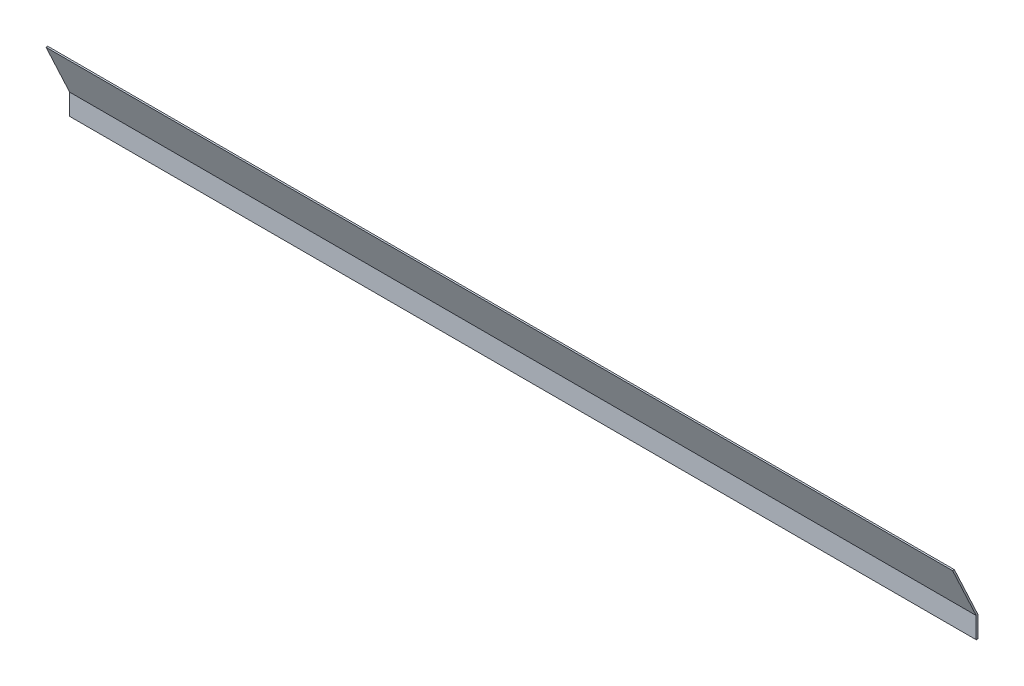
ISO-10303-21;
HEADER;
FILE_DESCRIPTION(('STEP AP214'),'2;1');
FILE_NAME('part.step','',(''),(''),'','','');
FILE_SCHEMA(('AUTOMOTIVE_DESIGN { 1 0 10303 214 1 1 1 1 }'));
ENDSEC;
DATA;
#1=APPLICATION_CONTEXT('core data for automotive mechanical design processes');
#2=APPLICATION_PROTOCOL_DEFINITION('international standard','automotive_design',2000,#1);
#3=PRODUCT_CONTEXT('',#1,'mechanical');
#4=PRODUCT('Part','Part','',(#3));
#5=PRODUCT_RELATED_PRODUCT_CATEGORY('part','',(#4));
#6=PRODUCT_DEFINITION_FORMATION('','',#4);
#7=PRODUCT_DEFINITION_CONTEXT('part definition',#1,'design');
#8=PRODUCT_DEFINITION('design','',#6,#7);
#9=PRODUCT_DEFINITION_SHAPE('','',#8);
#10=(LENGTH_UNIT() NAMED_UNIT(*) SI_UNIT(.MILLI.,.METRE.));
#11=(NAMED_UNIT(*) PLANE_ANGLE_UNIT() SI_UNIT($,.RADIAN.));
#12=(NAMED_UNIT(*) SI_UNIT($,.STERADIAN.) SOLID_ANGLE_UNIT());
#13=UNCERTAINTY_MEASURE_WITH_UNIT(LENGTH_MEASURE(1.E-05),#10,'distance_accuracy_value','');
#14=(GEOMETRIC_REPRESENTATION_CONTEXT(3) GLOBAL_UNCERTAINTY_ASSIGNED_CONTEXT((#13)) GLOBAL_UNIT_ASSIGNED_CONTEXT((#10,
#11,#12)) REPRESENTATION_CONTEXT('',''));
#15=CARTESIAN_POINT('',(0.,0.,0.));
#16=DIRECTION('',(0.,0.,1.));
#17=DIRECTION('',(1.,0.,0.));
#18=AXIS2_PLACEMENT_3D('',#15,#16,#17);
#19=CARTESIAN_POINT('',(0.,184.161742325847,92.2260307857102));
#20=DIRECTION('',(0.,-0.422618261740699,0.90630778703665));
#21=DIRECTION('',(0.,-0.90630778703665,-0.422618261740699));
#22=AXIS2_PLACEMENT_3D('',#19,#20,#21);
#23=PLANE('',#22);
#24=DIRECTION('',(0.,-0.90630778703665,-0.4226182617407));
#25=VECTOR('',#24,1.);
#26=CARTESIAN_POINT('',(3289.3,184.161742325847,92.2260307857102));
#27=LINE('',#26,#25);
#28=CARTESIAN_POINT('',(3289.3,184.161742325847,92.2260307857102));
#29=VERTEX_POINT('',#28);
#30=CARTESIAN_POINT('',(3289.3,0.,6.35000000000008));
#31=VERTEX_POINT('',#30);
#32=EDGE_CURVE('E103',#29,#31,#27,.T.);
#33=ORIENTED_EDGE('',*,*,#32,.F.);
#34=DIRECTION('',(1.,0.,0.));
#35=VECTOR('',#34,1.);
#36=CARTESIAN_POINT('',(0.,184.161742325847,92.2260307857102));
#37=LINE('',#36,#35);
#38=CARTESIAN_POINT('',(0.,184.161742325847,92.2260307857102));
#39=VERTEX_POINT('',#38);
#40=EDGE_CURVE('E75',#39,#29,#37,.T.);
#41=ORIENTED_EDGE('',*,*,#40,.F.);
#42=DIRECTION('',(0.,-0.90630778703665,-0.4226182617407));
#43=VECTOR('',#42,1.);
#44=CARTESIAN_POINT('',(0.,184.161742325847,92.2260307857102));
#45=LINE('',#44,#43);
#46=CARTESIAN_POINT('',(0.,0.,6.35000000000008));
#47=VERTEX_POINT('',#46);
#48=EDGE_CURVE('E72',#39,#47,#45,.T.);
#49=ORIENTED_EDGE('',*,*,#48,.T.);
#50=DIRECTION('',(1.,0.,0.));
#51=VECTOR('',#50,1.);
#52=CARTESIAN_POINT('',(0.,0.,6.35));
#53=LINE('',#52,#51);
#54=EDGE_CURVE('E20',#31,#47,#53,.F.);
#55=ORIENTED_EDGE('',*,*,#54,.F.);
#56=EDGE_LOOP('',(#33,#41,#49,#55));
#57=FACE_BOUND('',#56,.T.);
#58=ADVANCED_FACE('F17',(#57),#23,.T.);
#59=CARTESIAN_POINT('',(0.,0.,6.35));
#60=DIRECTION('',(0.,0.,1.));
#61=DIRECTION('',(1.,0.,0.));
#62=AXIS2_PLACEMENT_3D('',#59,#60,#61);
#63=PLANE('',#62);
#64=DIRECTION('',(0.,1.,0.));
#65=VECTOR('',#64,1.);
#66=CARTESIAN_POINT('',(3289.3,56.5193055194773,6.35));
#67=LINE('',#66,#65);
#68=CARTESIAN_POINT('',(3289.3,-76.2,6.35));
#69=VERTEX_POINT('',#68);
#70=EDGE_CURVE('E82',#31,#69,#67,.F.);
#71=ORIENTED_EDGE('',*,*,#70,.F.);
#72=ORIENTED_EDGE('',*,*,#54,.T.);
#73=DIRECTION('',(0.,1.,0.));
#74=VECTOR('',#73,1.);
#75=CARTESIAN_POINT('',(0.,56.5193055194773,6.35));
#76=LINE('',#75,#74);
#77=CARTESIAN_POINT('',(0.,-76.2,6.35));
#78=VERTEX_POINT('',#77);
#79=EDGE_CURVE('E67',#47,#78,#76,.F.);
#80=ORIENTED_EDGE('',*,*,#79,.T.);
#81=DIRECTION('',(1.,0.,0.));
#82=VECTOR('',#81,1.);
#83=CARTESIAN_POINT('',(0.,-76.2,6.35));
#84=LINE('',#83,#82);
#85=EDGE_CURVE('E78',#69,#78,#84,.F.);
#86=ORIENTED_EDGE('',*,*,#85,.F.);
#87=EDGE_LOOP('',(#71,#72,#80,#86));
#88=FACE_BOUND('',#87,.T.);
#89=ADVANCED_FACE('F80',(#88),#63,.T.);
#90=CARTESIAN_POINT('',(0.,-76.2,6.35));
#91=DIRECTION('',(0.,-1.,0.));
#92=DIRECTION('',(0.,0.,-1.));
#93=AXIS2_PLACEMENT_3D('',#90,#91,#92);
#94=PLANE('',#93);
#95=DIRECTION('',(0.,0.,-1.));
#96=VECTOR('',#95,1.);
#97=CARTESIAN_POINT('',(3289.3,-76.2,34.6628779547605));
#98=LINE('',#97,#96);
#99=CARTESIAN_POINT('',(3289.3,-76.2,0.));
#100=VERTEX_POINT('',#99);
#101=EDGE_CURVE('E96',#69,#100,#98,.T.);
#102=ORIENTED_EDGE('',*,*,#101,.F.);
#103=ORIENTED_EDGE('',*,*,#85,.T.);
#104=DIRECTION('',(0.,0.,-1.));
#105=VECTOR('',#104,1.);
#106=CARTESIAN_POINT('',(0.,-76.2,34.6628779547605));
#107=LINE('',#106,#105);
#108=CARTESIAN_POINT('',(0.,-76.2,0.));
#109=VERTEX_POINT('',#108);
#110=EDGE_CURVE('E87',#78,#109,#107,.T.);
#111=ORIENTED_EDGE('',*,*,#110,.T.);
#112=DIRECTION('',(-1.,0.,0.));
#113=VECTOR('',#112,1.);
#114=CARTESIAN_POINT('',(0.,-76.2,0.));
#115=LINE('',#114,#113);
#116=EDGE_CURVE('E98',#100,#109,#115,.T.);
#117=ORIENTED_EDGE('',*,*,#116,.F.);
#118=EDGE_LOOP('',(#102,#103,#111,#117));
#119=FACE_BOUND('',#118,.T.);
#120=ADVANCED_FACE('F94',(#119),#94,.T.);
#121=CARTESIAN_POINT('',(0.,56.5193055194773,34.6628779547605));
#122=DIRECTION('',(1.,0.,0.));
#123=DIRECTION('',(0.,0.,-1.));
#124=AXIS2_PLACEMENT_3D('',#121,#122,#123);
#125=PLANE('',#124);
#126=ORIENTED_EDGE('',*,*,#110,.F.);
#127=ORIENTED_EDGE('',*,*,#79,.F.);
#128=ORIENTED_EDGE('',*,*,#48,.F.);
#129=DIRECTION('',(0.,0.,1.));
#130=VECTOR('',#129,1.);
#131=CARTESIAN_POINT('',(0.,184.161742325847,85.8760307857102));
#132=LINE('',#131,#130);
#133=CARTESIAN_POINT('',(0.,184.161742325847,85.8760307857102));
#134=VERTEX_POINT('',#133);
#135=EDGE_CURVE('E89',#134,#39,#132,.T.);
#136=ORIENTED_EDGE('',*,*,#135,.F.);
#137=DIRECTION('',(0.,0.90630778703665,0.422618261740699));
#138=VECTOR('',#137,1.);
#139=CARTESIAN_POINT('',(0.,0.,0.));
#140=LINE('',#139,#138);
#141=CARTESIAN_POINT('',(0.,0.,0.));
#142=VERTEX_POINT('',#141);
#143=EDGE_CURVE('E116',#142,#134,#140,.T.);
#144=ORIENTED_EDGE('',*,*,#143,.F.);
#145=DIRECTION('',(0.,1.,0.));
#146=VECTOR('',#145,1.);
#147=CARTESIAN_POINT('',(0.,-76.2,0.));
#148=LINE('',#147,#146);
#149=EDGE_CURVE('E99',#109,#142,#148,.T.);
#150=ORIENTED_EDGE('',*,*,#149,.F.);
#151=EDGE_LOOP('',(#126,#127,#128,#136,#144,#150));
#152=FACE_BOUND('',#151,.T.);
#153=ADVANCED_FACE('F85',(#152),#125,.F.);
#154=CARTESIAN_POINT('',(0.,184.161742325847,85.8760307857102));
#155=DIRECTION('',(0.,1.,0.));
#156=DIRECTION('',(0.,0.,1.));
#157=AXIS2_PLACEMENT_3D('',#154,#155,#156);
#158=PLANE('',#157);
#159=DIRECTION('',(0.,0.,-1.));
#160=VECTOR('',#159,1.);
#161=CARTESIAN_POINT('',(3289.3,184.161742325847,34.6628779547605));
#162=LINE('',#161,#160);
#163=CARTESIAN_POINT('',(3289.3,184.161742325847,85.8760307857102));
#164=VERTEX_POINT('',#163);
#165=EDGE_CURVE('E105',#164,#29,#162,.F.);
#166=ORIENTED_EDGE('',*,*,#165,.F.);
#167=DIRECTION('',(1.,0.,0.));
#168=VECTOR('',#167,1.);
#169=CARTESIAN_POINT('',(0.,184.161742325847,85.8760307857101));
#170=LINE('',#169,#168);
#171=EDGE_CURVE('E114',#134,#164,#170,.T.);
#172=ORIENTED_EDGE('',*,*,#171,.F.);
#173=ORIENTED_EDGE('',*,*,#135,.T.);
#174=ORIENTED_EDGE('',*,*,#40,.T.);
#175=EDGE_LOOP('',(#166,#172,#173,#174));
#176=FACE_BOUND('',#175,.T.);
#177=ADVANCED_FACE('F112',(#176),#158,.T.);
#178=CARTESIAN_POINT('',(3289.3,56.5193055194773,34.6628779547605));
#179=DIRECTION('',(1.,0.,0.));
#180=DIRECTION('',(0.,0.,-1.));
#181=AXIS2_PLACEMENT_3D('',#178,#179,#180);
#182=PLANE('',#181);
#183=ORIENTED_EDGE('',*,*,#70,.T.);
#184=ORIENTED_EDGE('',*,*,#101,.T.);
#185=DIRECTION('',(0.,1.,0.));
#186=VECTOR('',#185,1.);
#187=CARTESIAN_POINT('',(3289.3,-76.2,0.));
#188=LINE('',#187,#186);
#189=CARTESIAN_POINT('',(3289.3,0.,0.));
#190=VERTEX_POINT('',#189);
#191=EDGE_CURVE('E35',#190,#100,#188,.F.);
#192=ORIENTED_EDGE('',*,*,#191,.F.);
#193=DIRECTION('',(0.,0.90630778703665,0.422618261740699));
#194=VECTOR('',#193,1.);
#195=CARTESIAN_POINT('',(3289.3,0.,0.));
#196=LINE('',#195,#194);
#197=EDGE_CURVE('E26',#164,#190,#196,.F.);
#198=ORIENTED_EDGE('',*,*,#197,.F.);
#199=ORIENTED_EDGE('',*,*,#165,.T.);
#200=ORIENTED_EDGE('',*,*,#32,.T.);
#201=EDGE_LOOP('',(#183,#184,#192,#198,#199,#200));
#202=FACE_BOUND('',#201,.T.);
#203=ADVANCED_FACE('F101',(#202),#182,.T.);
#204=CARTESIAN_POINT('',(0.,-76.2,0.));
#205=DIRECTION('',(0.,0.,-1.));
#206=DIRECTION('',(-1.,0.,0.));
#207=AXIS2_PLACEMENT_3D('',#204,#205,#206);
#208=PLANE('',#207);
#209=ORIENTED_EDGE('',*,*,#191,.T.);
#210=ORIENTED_EDGE('',*,*,#116,.T.);
#211=ORIENTED_EDGE('',*,*,#149,.T.);
#212=DIRECTION('',(1.,0.,0.));
#213=VECTOR('',#212,1.);
#214=CARTESIAN_POINT('',(0.,0.,0.));
#215=LINE('',#214,#213);
#216=EDGE_CURVE('E11',#190,#142,#215,.F.);
#217=ORIENTED_EDGE('',*,*,#216,.F.);
#218=EDGE_LOOP('',(#209,#210,#211,#217));
#219=FACE_BOUND('',#218,.T.);
#220=ADVANCED_FACE('F121',(#219),#208,.T.);
#221=CARTESIAN_POINT('',(0.,0.,0.));
#222=DIRECTION('',(0.,0.422618261740699,-0.90630778703665));
#223=DIRECTION('',(0.,0.90630778703665,0.422618261740699));
#224=AXIS2_PLACEMENT_3D('',#221,#222,#223);
#225=PLANE('',#224);
#226=ORIENTED_EDGE('',*,*,#197,.T.);
#227=ORIENTED_EDGE('',*,*,#216,.T.);
#228=ORIENTED_EDGE('',*,*,#143,.T.);
#229=ORIENTED_EDGE('',*,*,#171,.T.);
#230=EDGE_LOOP('',(#226,#227,#228,#229));
#231=FACE_BOUND('',#230,.T.);
#232=ADVANCED_FACE('F123',(#231),#225,.T.);
#233=CLOSED_SHELL('',(#58,#89,#120,#153,#177,#203,#220,#232));
#234=MANIFOLD_SOLID_BREP('B1',#233);
#235=ADVANCED_BREP_SHAPE_REPRESENTATION('',(#18,#234),#14);
#236=SHAPE_DEFINITION_REPRESENTATION(#9,#235);
ENDSEC;
END-ISO-10303-21;
